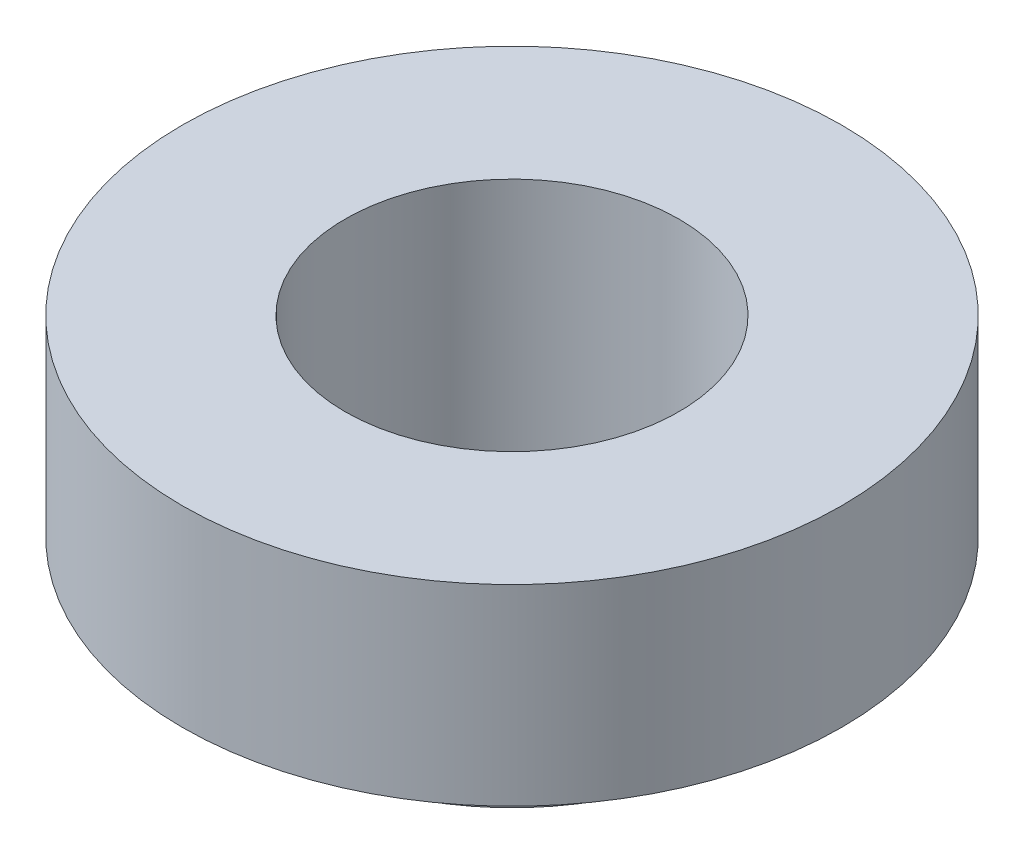
ISO-10303-21;
HEADER;
FILE_DESCRIPTION(('STEP AP214'),'2;1');
FILE_NAME('part.step','',(''),(''),'','','');
FILE_SCHEMA(('AUTOMOTIVE_DESIGN { 1 0 10303 214 1 1 1 1 }'));
ENDSEC;
DATA;
#1=APPLICATION_CONTEXT('core data for automotive mechanical design processes');
#2=APPLICATION_PROTOCOL_DEFINITION('international standard','automotive_design',2000,#1);
#3=PRODUCT_CONTEXT('',#1,'mechanical');
#4=PRODUCT('Part','Part','',(#3));
#5=PRODUCT_RELATED_PRODUCT_CATEGORY('part','',(#4));
#6=PRODUCT_DEFINITION_FORMATION('','',#4);
#7=PRODUCT_DEFINITION_CONTEXT('part definition',#1,'design');
#8=PRODUCT_DEFINITION('design','',#6,#7);
#9=PRODUCT_DEFINITION_SHAPE('','',#8);
#10=(LENGTH_UNIT() NAMED_UNIT(*) SI_UNIT(.MILLI.,.METRE.));
#11=(NAMED_UNIT(*) PLANE_ANGLE_UNIT() SI_UNIT($,.RADIAN.));
#12=(NAMED_UNIT(*) SI_UNIT($,.STERADIAN.) SOLID_ANGLE_UNIT());
#13=UNCERTAINTY_MEASURE_WITH_UNIT(LENGTH_MEASURE(1.E-05),#10,'distance_accuracy_value','');
#14=(GEOMETRIC_REPRESENTATION_CONTEXT(3) GLOBAL_UNCERTAINTY_ASSIGNED_CONTEXT((#13)) GLOBAL_UNIT_ASSIGNED_CONTEXT((#10,
#11,#12)) REPRESENTATION_CONTEXT('',''));
#15=CARTESIAN_POINT('',(0.,0.,0.));
#16=DIRECTION('',(0.,0.,1.));
#17=DIRECTION('',(1.,0.,0.));
#18=AXIS2_PLACEMENT_3D('',#15,#16,#17);
#19=CARTESIAN_POINT('',(0.,2.3,0.));
#20=DIRECTION('',(0.,-1.,0.));
#21=DIRECTION('',(0.,0.,-1.));
#22=AXIS2_PLACEMENT_3D('',#19,#20,#21);
#23=CYLINDRICAL_SURFACE('',#22,3.95);
#24=CARTESIAN_POINT('',(0.,2.3,0.));
#25=DIRECTION('',(0.,1.,0.));
#26=DIRECTION('',(0.,0.,1.));
#27=AXIS2_PLACEMENT_3D('',#24,#25,#26);
#28=CIRCLE('',#27,3.95);
#29=CARTESIAN_POINT('',(0.,2.3,3.95));
#30=VERTEX_POINT('',#29);
#31=EDGE_CURVE('E44',#30,#30,#28,.T.);
#32=ORIENTED_EDGE('',*,*,#31,.F.);
#33=EDGE_LOOP('',(#32));
#34=FACE_BOUND('',#33,.T.);
#35=CARTESIAN_POINT('',(0.,0.,0.));
#36=DIRECTION('',(0.,1.,0.));
#37=DIRECTION('',(0.,0.,1.));
#38=AXIS2_PLACEMENT_3D('',#35,#36,#37);
#39=CIRCLE('',#38,3.95);
#40=CARTESIAN_POINT('',(0.,0.,3.95));
#41=VERTEX_POINT('',#40);
#42=EDGE_CURVE('E40',#41,#41,#39,.T.);
#43=ORIENTED_EDGE('',*,*,#42,.T.);
#44=EDGE_LOOP('',(#43));
#45=FACE_BOUND('',#44,.T.);
#46=ADVANCED_FACE('F37',(#34,#45),#23,.T.);
#47=CARTESIAN_POINT('',(0.,2.3,0.));
#48=DIRECTION('',(0.,1.,0.));
#49=DIRECTION('',(0.,0.,1.));
#50=AXIS2_PLACEMENT_3D('',#47,#48,#49);
#51=PLANE('',#50);
#52=CARTESIAN_POINT('',(0.,2.3,0.));
#53=DIRECTION('',(0.,1.,0.));
#54=DIRECTION('',(0.,0.,1.));
#55=AXIS2_PLACEMENT_3D('',#52,#53,#54);
#56=CIRCLE('',#55,2.);
#57=CARTESIAN_POINT('',(0.,2.3,2.));
#58=VERTEX_POINT('',#57);
#59=EDGE_CURVE('E53',#58,#58,#56,.T.);
#60=ORIENTED_EDGE('',*,*,#59,.F.);
#61=EDGE_LOOP('',(#60));
#62=FACE_BOUND('',#61,.T.);
#63=ORIENTED_EDGE('',*,*,#31,.T.);
#64=EDGE_LOOP('',(#63));
#65=FACE_BOUND('',#64,.T.);
#66=ADVANCED_FACE('F76',(#62,#65),#51,.T.);
#67=CARTESIAN_POINT('',(0.,0.,0.));
#68=DIRECTION('',(0.,1.,0.));
#69=DIRECTION('',(0.,0.,1.));
#70=AXIS2_PLACEMENT_3D('',#67,#68,#69);
#71=PLANE('',#70);
#72=CARTESIAN_POINT('',(0.,0.,0.));
#73=DIRECTION('',(0.,-1.,0.));
#74=DIRECTION('',(0.,0.,-1.));
#75=AXIS2_PLACEMENT_3D('',#72,#73,#74);
#76=CIRCLE('',#75,2.7);
#77=CARTESIAN_POINT('',(0.,0.,-2.7));
#78=VERTEX_POINT('',#77);
#79=EDGE_CURVE('E10',#78,#78,#76,.T.);
#80=ORIENTED_EDGE('',*,*,#79,.F.);
#81=EDGE_LOOP('',(#80));
#82=FACE_BOUND('',#81,.T.);
#83=ORIENTED_EDGE('',*,*,#42,.F.);
#84=EDGE_LOOP('',(#83));
#85=FACE_BOUND('',#84,.T.);
#86=ADVANCED_FACE('F70',(#82,#85),#71,.F.);
#87=CARTESIAN_POINT('',(0.,-0.9,0.));
#88=DIRECTION('',(0.,1.,0.));
#89=DIRECTION('',(0.,0.,1.));
#90=AXIS2_PLACEMENT_3D('',#87,#88,#89);
#91=CYLINDRICAL_SURFACE('',#90,2.7);
#92=CARTESIAN_POINT('',(0.,-0.9,0.));
#93=DIRECTION('',(0.,-1.,0.));
#94=DIRECTION('',(0.,0.,-1.));
#95=AXIS2_PLACEMENT_3D('',#92,#93,#94);
#96=CIRCLE('',#95,2.7);
#97=CARTESIAN_POINT('',(0.,-0.9,-2.7));
#98=VERTEX_POINT('',#97);
#99=EDGE_CURVE('E50',#98,#98,#96,.T.);
#100=ORIENTED_EDGE('',*,*,#99,.F.);
#101=EDGE_LOOP('',(#100));
#102=FACE_BOUND('',#101,.T.);
#103=ORIENTED_EDGE('',*,*,#79,.T.);
#104=EDGE_LOOP('',(#103));
#105=FACE_BOUND('',#104,.T.);
#106=ADVANCED_FACE('F65',(#102,#105),#91,.T.);
#107=CARTESIAN_POINT('',(0.,-0.9,0.));
#108=DIRECTION('',(0.,-1.,0.));
#109=DIRECTION('',(0.,0.,-1.));
#110=AXIS2_PLACEMENT_3D('',#107,#108,#109);
#111=PLANE('',#110);
#112=CARTESIAN_POINT('',(0.,-0.9,0.));
#113=DIRECTION('',(0.,-1.,0.));
#114=DIRECTION('',(0.,0.,-1.));
#115=AXIS2_PLACEMENT_3D('',#112,#113,#114);
#116=CIRCLE('',#115,2.);
#117=CARTESIAN_POINT('',(0.,-0.9,-2.));
#118=VERTEX_POINT('',#117);
#119=EDGE_CURVE('E56',#118,#118,#116,.T.);
#120=ORIENTED_EDGE('',*,*,#119,.F.);
#121=EDGE_LOOP('',(#120));
#122=FACE_BOUND('',#121,.T.);
#123=ORIENTED_EDGE('',*,*,#99,.T.);
#124=EDGE_LOOP('',(#123));
#125=FACE_BOUND('',#124,.T.);
#126=ADVANCED_FACE('F62',(#122,#125),#111,.T.);
#127=CARTESIAN_POINT('',(0.,2.4,0.));
#128=DIRECTION('',(0.,-1.,0.));
#129=DIRECTION('',(0.,0.,-1.));
#130=AXIS2_PLACEMENT_3D('',#127,#128,#129);
#131=CYLINDRICAL_SURFACE('',#130,2.);
#132=ORIENTED_EDGE('',*,*,#59,.T.);
#133=EDGE_LOOP('',(#132));
#134=FACE_BOUND('',#133,.T.);
#135=ORIENTED_EDGE('',*,*,#119,.T.);
#136=EDGE_LOOP('',(#135));
#137=FACE_BOUND('',#136,.T.);
#138=ADVANCED_FACE('F60',(#134,#137),#131,.F.);
#139=CLOSED_SHELL('',(#46,#66,#86,#106,#126,#138));
#140=MANIFOLD_SOLID_BREP('B2',#139);
#141=ADVANCED_BREP_SHAPE_REPRESENTATION('',(#18,#140),#14);
#142=SHAPE_DEFINITION_REPRESENTATION(#9,#141);
ENDSEC;
END-ISO-10303-21;
